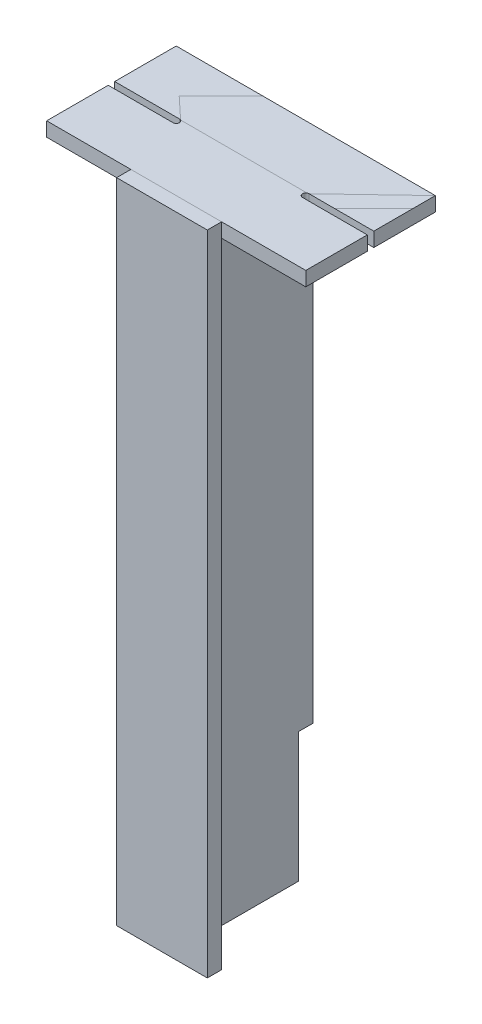
ISO-10303-21;
HEADER;
FILE_DESCRIPTION(('STEP AP214'),'2;1');
FILE_NAME('part.step','',(''),(''),'','','');
FILE_SCHEMA(('AUTOMOTIVE_DESIGN { 1 0 10303 214 1 1 1 1 }'));
ENDSEC;
DATA;
#1=APPLICATION_CONTEXT('core data for automotive mechanical design processes');
#2=APPLICATION_PROTOCOL_DEFINITION('international standard','automotive_design',2000,#1);
#3=PRODUCT_CONTEXT('',#1,'mechanical');
#4=PRODUCT('Part','Part','',(#3));
#5=PRODUCT_RELATED_PRODUCT_CATEGORY('part','',(#4));
#6=PRODUCT_DEFINITION_FORMATION('','',#4);
#7=PRODUCT_DEFINITION_CONTEXT('part definition',#1,'design');
#8=PRODUCT_DEFINITION('design','',#6,#7);
#9=PRODUCT_DEFINITION_SHAPE('','',#8);
#10=(LENGTH_UNIT() NAMED_UNIT(*) SI_UNIT(.MILLI.,.METRE.));
#11=(NAMED_UNIT(*) PLANE_ANGLE_UNIT() SI_UNIT($,.RADIAN.));
#12=(NAMED_UNIT(*) SI_UNIT($,.STERADIAN.) SOLID_ANGLE_UNIT());
#13=UNCERTAINTY_MEASURE_WITH_UNIT(LENGTH_MEASURE(1.E-05),#10,'distance_accuracy_value','');
#14=(GEOMETRIC_REPRESENTATION_CONTEXT(3) GLOBAL_UNCERTAINTY_ASSIGNED_CONTEXT((#13)) GLOBAL_UNIT_ASSIGNED_CONTEXT((#10,
#11,#12)) REPRESENTATION_CONTEXT('',''));
#15=CARTESIAN_POINT('',(0.,0.,0.));
#16=DIRECTION('',(0.,0.,1.));
#17=DIRECTION('',(1.,0.,0.));
#18=AXIS2_PLACEMENT_3D('',#15,#16,#17);
#19=CARTESIAN_POINT('',(-70.01,0.,-0.01));
#20=DIRECTION('',(0.,-1.,0.));
#21=DIRECTION('',(1.,0.,0.));
#22=AXIS2_PLACEMENT_3D('',#19,#20,#21);
#23=PLANE('',#22);
#24=DIRECTION('',(1.,0.,0.));
#25=VECTOR('',#24,1.);
#26=CARTESIAN_POINT('',(0.,0.,22.));
#27=LINE('',#26,#25);
#28=CARTESIAN_POINT('',(-70.,0.,22.));
#29=VERTEX_POINT('',#28);
#30=CARTESIAN_POINT('',(70.,0.,22.));
#31=VERTEX_POINT('',#30);
#32=EDGE_CURVE('P0_E69',#29,#31,#27,.T.);
#33=ORIENTED_EDGE('',*,*,#32,.F.);
#34=DIRECTION('',(0.,0.,1.));
#35=VECTOR('',#34,1.);
#36=CARTESIAN_POINT('',(-70.,1.09170688439818E-13,11.));
#37=LINE('',#36,#35);
#38=CARTESIAN_POINT('',(-70.,0.,0.));
#39=VERTEX_POINT('',#38);
#40=EDGE_CURVE('P0_E56',#39,#29,#37,.T.);
#41=ORIENTED_EDGE('',*,*,#40,.F.);
#42=DIRECTION('',(-1.,0.,0.));
#43=VECTOR('',#42,1.);
#44=CARTESIAN_POINT('',(0.,0.,0.));
#45=LINE('',#44,#43);
#46=CARTESIAN_POINT('',(70.,0.,0.));
#47=VERTEX_POINT('',#46);
#48=EDGE_CURVE('P0_E21',#47,#39,#45,.T.);
#49=ORIENTED_EDGE('',*,*,#48,.F.);
#50=DIRECTION('',(0.,0.,-1.));
#51=VECTOR('',#50,1.);
#52=CARTESIAN_POINT('',(70.,0.,11.));
#53=LINE('',#52,#51);
#54=EDGE_CURVE('P0_E82',#31,#47,#53,.T.);
#55=ORIENTED_EDGE('',*,*,#54,.F.);
#56=EDGE_LOOP('',(#33,#41,#49,#55));
#57=FACE_BOUND('',#56,.T.);
#58=ADVANCED_FACE('P0_F17',(#57),#23,.T.);
#59=CARTESIAN_POINT('',(70.01,-0.00999999999997669,0.));
#60=DIRECTION('',(0.,0.,-1.));
#61=DIRECTION('',(-1.,0.,0.));
#62=AXIS2_PLACEMENT_3D('',#59,#60,#61);
#63=PLANE('',#62);
#64=DIRECTION('',(0.,1.,0.));
#65=VECTOR('',#64,1.);
#66=CARTESIAN_POINT('',(70.,500.,0.));
#67=LINE('',#66,#65);
#68=CARTESIAN_POINT('',(70.,1000.,0.));
#69=VERTEX_POINT('',#68);
#70=EDGE_CURVE('P0_E65',#47,#69,#67,.T.);
#71=ORIENTED_EDGE('',*,*,#70,.F.);
#72=ORIENTED_EDGE('',*,*,#48,.T.);
#73=DIRECTION('',(0.,-1.,0.));
#74=VECTOR('',#73,1.);
#75=CARTESIAN_POINT('',(-70.,500.,0.));
#76=LINE('',#75,#74);
#77=CARTESIAN_POINT('',(-70.,1000.,0.));
#78=VERTEX_POINT('',#77);
#79=EDGE_CURVE('P0_E62',#78,#39,#76,.T.);
#80=ORIENTED_EDGE('',*,*,#79,.F.);
#81=DIRECTION('',(-1.,0.,0.));
#82=VECTOR('',#81,1.);
#83=CARTESIAN_POINT('',(0.,1000.,0.));
#84=LINE('',#83,#82);
#85=EDGE_CURVE('P0_E84',#69,#78,#84,.T.);
#86=ORIENTED_EDGE('',*,*,#85,.F.);
#87=EDGE_LOOP('',(#71,#72,#80,#86));
#88=FACE_BOUND('',#87,.T.);
#89=ADVANCED_FACE('P0_F61',(#88),#63,.T.);
#90=CARTESIAN_POINT('',(-70.,1000.01,-0.01));
#91=DIRECTION('',(-1.,0.,0.));
#92=DIRECTION('',(0.,-1.,0.));
#93=AXIS2_PLACEMENT_3D('',#90,#91,#92);
#94=PLANE('',#93);
#95=DIRECTION('',(0.,-1.,0.));
#96=VECTOR('',#95,1.);
#97=CARTESIAN_POINT('',(-70.,500.,22.));
#98=LINE('',#97,#96);
#99=CARTESIAN_POINT('',(-70.,1000.,22.));
#100=VERTEX_POINT('',#99);
#101=EDGE_CURVE('P0_E71',#100,#29,#98,.T.);
#102=ORIENTED_EDGE('',*,*,#101,.F.);
#103=DIRECTION('',(0.,0.,1.));
#104=VECTOR('',#103,1.);
#105=CARTESIAN_POINT('',(-70.,1000.,11.));
#106=LINE('',#105,#104);
#107=EDGE_CURVE('P0_E75',#78,#100,#106,.T.);
#108=ORIENTED_EDGE('',*,*,#107,.F.);
#109=ORIENTED_EDGE('',*,*,#79,.T.);
#110=ORIENTED_EDGE('',*,*,#40,.T.);
#111=EDGE_LOOP('',(#102,#108,#109,#110));
#112=FACE_BOUND('',#111,.T.);
#113=ADVANCED_FACE('P0_F73',(#112),#94,.T.);
#114=CARTESIAN_POINT('',(-70.01,-0.00999999999997669,22.));
#115=DIRECTION('',(0.,0.,1.));
#116=DIRECTION('',(1.,0.,0.));
#117=AXIS2_PLACEMENT_3D('',#114,#115,#116);
#118=PLANE('',#117);
#119=DIRECTION('',(0.,-1.,0.));
#120=VECTOR('',#119,1.);
#121=CARTESIAN_POINT('',(70.,500.,22.));
#122=LINE('',#121,#120);
#123=CARTESIAN_POINT('',(70.,1000.,22.));
#124=VERTEX_POINT('',#123);
#125=EDGE_CURVE('P0_E36',#124,#31,#122,.T.);
#126=ORIENTED_EDGE('',*,*,#125,.F.);
#127=DIRECTION('',(1.,0.,0.));
#128=VECTOR('',#127,1.);
#129=CARTESIAN_POINT('',(0.,1000.,22.));
#130=LINE('',#129,#128);
#131=EDGE_CURVE('P0_E27',#100,#124,#130,.T.);
#132=ORIENTED_EDGE('',*,*,#131,.F.);
#133=ORIENTED_EDGE('',*,*,#101,.T.);
#134=ORIENTED_EDGE('',*,*,#32,.T.);
#135=EDGE_LOOP('',(#126,#132,#133,#134));
#136=FACE_BOUND('',#135,.T.);
#137=ADVANCED_FACE('P0_F89',(#136),#118,.T.);
#138=CARTESIAN_POINT('',(70.,-0.01,-0.01));
#139=DIRECTION('',(1.,0.,0.));
#140=DIRECTION('',(0.,1.,0.));
#141=AXIS2_PLACEMENT_3D('',#138,#139,#140);
#142=PLANE('',#141);
#143=ORIENTED_EDGE('',*,*,#125,.T.);
#144=ORIENTED_EDGE('',*,*,#54,.T.);
#145=ORIENTED_EDGE('',*,*,#70,.T.);
#146=DIRECTION('',(0.,0.,-1.));
#147=VECTOR('',#146,1.);
#148=CARTESIAN_POINT('',(70.,1000.,11.));
#149=LINE('',#148,#147);
#150=EDGE_CURVE('P0_E11',#124,#69,#149,.T.);
#151=ORIENTED_EDGE('',*,*,#150,.F.);
#152=EDGE_LOOP('',(#143,#144,#145,#151));
#153=FACE_BOUND('',#152,.T.);
#154=ADVANCED_FACE('P0_F91',(#153),#142,.T.);
#155=CARTESIAN_POINT('',(70.01,1000.,-0.01));
#156=DIRECTION('',(0.,1.,0.));
#157=DIRECTION('',(-1.,0.,0.));
#158=AXIS2_PLACEMENT_3D('',#155,#156,#157);
#159=PLANE('',#158);
#160=ORIENTED_EDGE('',*,*,#131,.T.);
#161=ORIENTED_EDGE('',*,*,#150,.T.);
#162=ORIENTED_EDGE('',*,*,#85,.T.);
#163=ORIENTED_EDGE('',*,*,#107,.T.);
#164=EDGE_LOOP('',(#160,#161,#162,#163));
#165=FACE_BOUND('',#164,.T.);
#166=ADVANCED_FACE('P0_F19',(#165),#159,.T.);
#167=CLOSED_SHELL('',(#58,#89,#113,#137,#154,#166));
#168=MANIFOLD_SOLID_BREP('P0_B1',#167);
#169=CARTESIAN_POINT('',(99.99,1000.01,-95.));
#170=DIRECTION('',(0.,0.,-1.));
#171=DIRECTION('',(1.,0.,0.));
#172=AXIS2_PLACEMENT_3D('',#169,#170,#171);
#173=PLANE('',#172);
#174=DIRECTION('',(-1.,0.,0.));
#175=VECTOR('',#174,1.);
#176=CARTESIAN_POINT('',(100.,1000.,-95.));
#177=LINE('',#176,#175);
#178=CARTESIAN_POINT('',(200.,1000.,-95.));
#179=VERTEX_POINT('',#178);
#180=CARTESIAN_POINT('',(100.,1000.,-95.));
#181=VERTEX_POINT('',#180);
#182=EDGE_CURVE('P1_E199',#179,#181,#177,.T.);
#183=ORIENTED_EDGE('',*,*,#182,.F.);
#184=DIRECTION('',(0.,1.,0.));
#185=VECTOR('',#184,1.);
#186=CARTESIAN_POINT('',(200.,989.,-95.));
#187=LINE('',#186,#185);
#188=CARTESIAN_POINT('',(200.,978.,-95.));
#189=VERTEX_POINT('',#188);
#190=EDGE_CURVE('P1_E122',#189,#179,#187,.T.);
#191=ORIENTED_EDGE('',*,*,#190,.F.);
#192=DIRECTION('',(1.,0.,0.));
#193=VECTOR('',#192,1.);
#194=CARTESIAN_POINT('',(0.,978.,-95.));
#195=LINE('',#194,#193);
#196=CARTESIAN_POINT('',(100.,978.,-95.));
#197=VERTEX_POINT('',#196);
#198=EDGE_CURVE('P1_E121',#197,#189,#195,.T.);
#199=ORIENTED_EDGE('',*,*,#198,.F.);
#200=DIRECTION('',(0.,-1.,0.));
#201=VECTOR('',#200,1.);
#202=CARTESIAN_POINT('',(100.,989.,-95.));
#203=LINE('',#202,#201);
#204=EDGE_CURVE('P1_E109',#181,#197,#203,.T.);
#205=ORIENTED_EDGE('',*,*,#204,.F.);
#206=EDGE_LOOP('',(#183,#191,#199,#205));
#207=FACE_BOUND('',#206,.T.);
#208=ADVANCED_FACE('P1_F17',(#207),#173,.T.);
#209=CARTESIAN_POINT('',(100.,1000.,-100.));
#210=DIRECTION('',(0.,-1.,0.));
#211=DIRECTION('',(0.,0.,-1.));
#212=AXIS2_PLACEMENT_3D('',#209,#210,#211);
#213=CYLINDRICAL_SURFACE('',#212,5.);
#214=CARTESIAN_POINT('',(100.,1000.,-100.));
#215=DIRECTION('',(0.,-1.,0.));
#216=DIRECTION('',(0.,0.,-1.));
#217=AXIS2_PLACEMENT_3D('',#214,#215,#216);
#218=CIRCLE('',#217,5.);
#219=CARTESIAN_POINT('',(100.,1000.,-105.));
#220=VERTEX_POINT('',#219);
#221=EDGE_CURVE('P1_E115',#181,#220,#218,.T.);
#222=ORIENTED_EDGE('',*,*,#221,.F.);
#223=ORIENTED_EDGE('',*,*,#204,.T.);
#224=CARTESIAN_POINT('',(100.,978.,-100.));
#225=DIRECTION('',(0.,-1.,0.));
#226=DIRECTION('',(0.,0.,-1.));
#227=AXIS2_PLACEMENT_3D('',#224,#225,#226);
#228=CIRCLE('',#227,5.);
#229=CARTESIAN_POINT('',(100.,978.,-105.));
#230=VERTEX_POINT('',#229);
#231=EDGE_CURVE('P1_E21',#230,#197,#228,.F.);
#232=ORIENTED_EDGE('',*,*,#231,.F.);
#233=DIRECTION('',(0.,-1.,0.));
#234=VECTOR('',#233,1.);
#235=CARTESIAN_POINT('',(100.,989.,-105.));
#236=LINE('',#235,#234);
#237=EDGE_CURVE('P1_E104',#220,#230,#236,.T.);
#238=ORIENTED_EDGE('',*,*,#237,.F.);
#239=EDGE_LOOP('',(#222,#223,#232,#238));
#240=FACE_BOUND('',#239,.T.);
#241=ADVANCED_FACE('P1_F111',(#240),#213,.F.);
#242=CARTESIAN_POINT('',(200.01,1000.01,-105.));
#243=DIRECTION('',(0.,0.,1.));
#244=DIRECTION('',(-1.,0.,0.));
#245=AXIS2_PLACEMENT_3D('',#242,#243,#244);
#246=PLANE('',#245);
#247=DIRECTION('',(1.,0.,0.));
#248=VECTOR('',#247,1.);
#249=CARTESIAN_POINT('',(100.,1000.,-105.));
#250=LINE('',#249,#248);
#251=CARTESIAN_POINT('',(200.,1000.,-105.));
#252=VERTEX_POINT('',#251);
#253=EDGE_CURVE('P1_E175',#220,#252,#250,.T.);
#254=ORIENTED_EDGE('',*,*,#253,.F.);
#255=ORIENTED_EDGE('',*,*,#237,.T.);
#256=DIRECTION('',(-1.,0.,0.));
#257=VECTOR('',#256,1.);
#258=CARTESIAN_POINT('',(0.,978.,-105.));
#259=LINE('',#258,#257);
#260=CARTESIAN_POINT('',(200.,978.,-105.));
#261=VERTEX_POINT('',#260);
#262=EDGE_CURVE('P1_E128',#261,#230,#259,.T.);
#263=ORIENTED_EDGE('',*,*,#262,.F.);
#264=DIRECTION('',(0.,-1.,0.));
#265=VECTOR('',#264,1.);
#266=CARTESIAN_POINT('',(200.,989.,-105.));
#267=LINE('',#266,#265);
#268=EDGE_CURVE('P1_E131',#252,#261,#267,.T.);
#269=ORIENTED_EDGE('',*,*,#268,.F.);
#270=EDGE_LOOP('',(#254,#255,#263,#269));
#271=FACE_BOUND('',#270,.T.);
#272=ADVANCED_FACE('P1_F288',(#271),#246,.T.);
#273=CARTESIAN_POINT('',(200.,1000.01,-104.99));
#274=DIRECTION('',(1.,0.,0.));
#275=DIRECTION('',(0.,-1.,0.));
#276=AXIS2_PLACEMENT_3D('',#273,#274,#275);
#277=PLANE('',#276);
#278=DIRECTION('',(0.,-1.,0.));
#279=VECTOR('',#278,1.);
#280=CARTESIAN_POINT('',(200.,989.,-200.));
#281=LINE('',#280,#279);
#282=CARTESIAN_POINT('',(200.,1000.,-200.));
#283=VERTEX_POINT('',#282);
#284=CARTESIAN_POINT('',(200.,978.,-200.));
#285=VERTEX_POINT('',#284);
#286=EDGE_CURVE('P1_E169',#283,#285,#281,.T.);
#287=ORIENTED_EDGE('',*,*,#286,.F.);
#288=DIRECTION('',(0.,0.,-1.));
#289=VECTOR('',#288,1.);
#290=CARTESIAN_POINT('',(200.,1000.,-100.));
#291=LINE('',#290,#289);
#292=EDGE_CURVE('P1_E170',#252,#283,#291,.T.);
#293=ORIENTED_EDGE('',*,*,#292,.F.);
#294=ORIENTED_EDGE('',*,*,#268,.T.);
#295=DIRECTION('',(0.,0.,1.));
#296=VECTOR('',#295,1.);
#297=CARTESIAN_POINT('',(200.,978.,-100.));
#298=LINE('',#297,#296);
#299=EDGE_CURVE('P1_E129',#285,#261,#298,.T.);
#300=ORIENTED_EDGE('',*,*,#299,.F.);
#301=EDGE_LOOP('',(#287,#293,#294,#300));
#302=FACE_BOUND('',#301,.T.);
#303=ADVANCED_FACE('P1_F287',(#302),#277,.T.);
#304=CARTESIAN_POINT('',(200.01,978.,0.01));
#305=DIRECTION('',(0.,-1.,0.));
#306=DIRECTION('',(-1.,0.,0.));
#307=AXIS2_PLACEMENT_3D('',#304,#305,#306);
#308=PLANE('',#307);
#309=DIRECTION('',(-1.,0.,0.));
#310=VECTOR('',#309,1.);
#311=CARTESIAN_POINT('',(-150.,978.,-95.));
#312=LINE('',#311,#310);
#313=CARTESIAN_POINT('',(-100.,978.,-95.));
#314=VERTEX_POINT('',#313);
#315=CARTESIAN_POINT('',(-200.,978.,-95.));
#316=VERTEX_POINT('',#315);
#317=EDGE_CURVE('P1_E149',#314,#316,#312,.T.);
#318=ORIENTED_EDGE('',*,*,#317,.F.);
#319=CARTESIAN_POINT('',(-100.,978.,-100.));
#320=DIRECTION('',(0.,-1.,0.));
#321=DIRECTION('',(0.,0.,-1.));
#322=AXIS2_PLACEMENT_3D('',#319,#320,#321);
#323=CIRCLE('',#322,5.);
#324=CARTESIAN_POINT('',(-100.,978.,-105.));
#325=VERTEX_POINT('',#324);
#326=EDGE_CURVE('P1_E197',#325,#314,#323,.T.);
#327=ORIENTED_EDGE('',*,*,#326,.F.);
#328=DIRECTION('',(1.,0.,0.));
#329=VECTOR('',#328,1.);
#330=CARTESIAN_POINT('',(-150.,978.,-105.));
#331=LINE('',#330,#329);
#332=CARTESIAN_POINT('',(-200.,978.,-105.));
#333=VERTEX_POINT('',#332);
#334=EDGE_CURVE('P1_E155',#333,#325,#331,.T.);
#335=ORIENTED_EDGE('',*,*,#334,.F.);
#336=DIRECTION('',(0.,0.,1.));
#337=VECTOR('',#336,1.);
#338=CARTESIAN_POINT('',(-200.,978.,-152.5));
#339=LINE('',#338,#337);
#340=CARTESIAN_POINT('',(-200.,978.,-200.));
#341=VERTEX_POINT('',#340);
#342=EDGE_CURVE('P1_E159',#341,#333,#339,.T.);
#343=ORIENTED_EDGE('',*,*,#342,.F.);
#344=DIRECTION('',(-1.,0.,0.));
#345=VECTOR('',#344,1.);
#346=CARTESIAN_POINT('',(0.,978.,-200.));
#347=LINE('',#346,#345);
#348=EDGE_CURVE('P1_E167',#285,#341,#347,.T.);
#349=ORIENTED_EDGE('',*,*,#348,.F.);
#350=ORIENTED_EDGE('',*,*,#299,.T.);
#351=ORIENTED_EDGE('',*,*,#262,.T.);
#352=ORIENTED_EDGE('',*,*,#231,.T.);
#353=ORIENTED_EDGE('',*,*,#198,.T.);
#354=DIRECTION('',(0.,0.,-1.));
#355=VECTOR('',#354,1.);
#356=CARTESIAN_POINT('',(200.,978.,-47.5));
#357=LINE('',#356,#355);
#358=CARTESIAN_POINT('',(200.,978.,0.));
#359=VERTEX_POINT('',#358);
#360=EDGE_CURVE('P1_E189',#359,#189,#357,.T.);
#361=ORIENTED_EDGE('',*,*,#360,.F.);
#362=DIRECTION('',(1.,0.,0.));
#363=VECTOR('',#362,1.);
#364=CARTESIAN_POINT('',(0.,978.,0.));
#365=LINE('',#364,#363);
#366=CARTESIAN_POINT('',(-200.,978.,0.));
#367=VERTEX_POINT('',#366);
#368=EDGE_CURVE('P1_E140',#367,#359,#365,.T.);
#369=ORIENTED_EDGE('',*,*,#368,.F.);
#370=DIRECTION('',(0.,0.,1.));
#371=VECTOR('',#370,1.);
#372=CARTESIAN_POINT('',(-200.,978.,-47.5));
#373=LINE('',#372,#371);
#374=EDGE_CURVE('P1_E138',#316,#367,#373,.T.);
#375=ORIENTED_EDGE('',*,*,#374,.F.);
#376=EDGE_LOOP('',(#318,#327,#335,#343,#349,#350,#351,#352,#353,#361,#369,#375));
#377=FACE_BOUND('',#376,.T.);
#378=ADVANCED_FACE('P1_F126',(#377),#308,.T.);
#379=CARTESIAN_POINT('',(200.,1000.01,0.01));
#380=DIRECTION('',(1.,0.,0.));
#381=DIRECTION('',(0.,-1.,0.));
#382=AXIS2_PLACEMENT_3D('',#379,#380,#381);
#383=PLANE('',#382);
#384=DIRECTION('',(0.,1.,0.));
#385=VECTOR('',#384,1.);
#386=CARTESIAN_POINT('',(200.,989.,0.));
#387=LINE('',#386,#385);
#388=CARTESIAN_POINT('',(200.,1000.,0.));
#389=VERTEX_POINT('',#388);
#390=EDGE_CURVE('P1_E146',#359,#389,#387,.T.);
#391=ORIENTED_EDGE('',*,*,#390,.F.);
#392=ORIENTED_EDGE('',*,*,#360,.T.);
#393=ORIENTED_EDGE('',*,*,#190,.T.);
#394=DIRECTION('',(0.,0.,-1.));
#395=VECTOR('',#394,1.);
#396=CARTESIAN_POINT('',(200.,1000.,-100.));
#397=LINE('',#396,#395);
#398=EDGE_CURVE('P1_E203',#389,#179,#397,.T.);
#399=ORIENTED_EDGE('',*,*,#398,.F.);
#400=EDGE_LOOP('',(#391,#392,#393,#399));
#401=FACE_BOUND('',#400,.T.);
#402=ADVANCED_FACE('P1_F317',(#401),#383,.T.);
#403=CARTESIAN_POINT('',(200.01,977.99,-200.));
#404=DIRECTION('',(0.,0.,-1.));
#405=DIRECTION('',(-1.,0.,0.));
#406=AXIS2_PLACEMENT_3D('',#403,#404,#405);
#407=PLANE('',#406);
#408=DIRECTION('',(-1.,0.,0.));
#409=VECTOR('',#408,1.);
#410=CARTESIAN_POINT('',(-100.,1000.,-200.));
#411=LINE('',#410,#409);
#412=CARTESIAN_POINT('',(-200.,1000.,-200.));
#413=VERTEX_POINT('',#412);
#414=EDGE_CURVE('P1_E145',#283,#413,#411,.T.);
#415=ORIENTED_EDGE('',*,*,#414,.F.);
#416=ORIENTED_EDGE('',*,*,#286,.T.);
#417=ORIENTED_EDGE('',*,*,#348,.T.);
#418=DIRECTION('',(0.,-1.,0.));
#419=VECTOR('',#418,1.);
#420=CARTESIAN_POINT('',(-200.,989.,-200.));
#421=LINE('',#420,#419);
#422=EDGE_CURVE('P1_E164',#413,#341,#421,.T.);
#423=ORIENTED_EDGE('',*,*,#422,.F.);
#424=EDGE_LOOP('',(#415,#416,#417,#423));
#425=FACE_BOUND('',#424,.T.);
#426=ADVANCED_FACE('P1_F268',(#425),#407,.T.);
#427=CARTESIAN_POINT('',(-200.,977.99,-104.99));
#428=DIRECTION('',(-1.,0.,0.));
#429=DIRECTION('',(0.,1.,0.));
#430=AXIS2_PLACEMENT_3D('',#427,#428,#429);
#431=PLANE('',#430);
#432=ORIENTED_EDGE('',*,*,#422,.T.);
#433=ORIENTED_EDGE('',*,*,#342,.T.);
#434=DIRECTION('',(0.,-1.,0.));
#435=VECTOR('',#434,1.);
#436=CARTESIAN_POINT('',(-200.,989.,-105.));
#437=LINE('',#436,#435);
#438=CARTESIAN_POINT('',(-200.,1000.,-105.));
#439=VERTEX_POINT('',#438);
#440=EDGE_CURVE('P1_E158',#439,#333,#437,.T.);
#441=ORIENTED_EDGE('',*,*,#440,.F.);
#442=DIRECTION('',(0.,0.,1.));
#443=VECTOR('',#442,1.);
#444=CARTESIAN_POINT('',(-200.,1000.,-100.));
#445=LINE('',#444,#443);
#446=EDGE_CURVE('P1_E251',#413,#439,#445,.T.);
#447=ORIENTED_EDGE('',*,*,#446,.F.);
#448=EDGE_LOOP('',(#432,#433,#441,#447));
#449=FACE_BOUND('',#448,.T.);
#450=ADVANCED_FACE('P1_F272',(#449),#431,.T.);
#451=CARTESIAN_POINT('',(-99.99,1000.01,-105.));
#452=DIRECTION('',(0.,0.,1.));
#453=DIRECTION('',(-1.,0.,0.));
#454=AXIS2_PLACEMENT_3D('',#451,#452,#453);
#455=PLANE('',#454);
#456=DIRECTION('',(1.,0.,0.));
#457=VECTOR('',#456,1.);
#458=CARTESIAN_POINT('',(-100.,1000.,-105.));
#459=LINE('',#458,#457);
#460=CARTESIAN_POINT('',(-100.,1000.,-105.));
#461=VERTEX_POINT('',#460);
#462=EDGE_CURVE('P1_E196',#439,#461,#459,.T.);
#463=ORIENTED_EDGE('',*,*,#462,.F.);
#464=ORIENTED_EDGE('',*,*,#440,.T.);
#465=ORIENTED_EDGE('',*,*,#334,.T.);
#466=DIRECTION('',(0.,-1.,0.));
#467=VECTOR('',#466,1.);
#468=CARTESIAN_POINT('',(-100.,989.,-105.));
#469=LINE('',#468,#467);
#470=EDGE_CURVE('P1_E152',#461,#325,#469,.T.);
#471=ORIENTED_EDGE('',*,*,#470,.F.);
#472=EDGE_LOOP('',(#463,#464,#465,#471));
#473=FACE_BOUND('',#472,.T.);
#474=ADVANCED_FACE('P1_F275',(#473),#455,.T.);
#475=CARTESIAN_POINT('',(-100.,1000.,-100.));
#476=DIRECTION('',(0.,-1.,0.));
#477=DIRECTION('',(0.,0.,-1.));
#478=AXIS2_PLACEMENT_3D('',#475,#476,#477);
#479=CYLINDRICAL_SURFACE('',#478,5.);
#480=CARTESIAN_POINT('',(-100.,1000.,-100.));
#481=DIRECTION('',(0.,-1.,0.));
#482=DIRECTION('',(0.,0.,-1.));
#483=AXIS2_PLACEMENT_3D('',#480,#481,#482);
#484=CIRCLE('',#483,5.);
#485=CARTESIAN_POINT('',(-100.,1000.,-95.));
#486=VERTEX_POINT('',#485);
#487=EDGE_CURVE('P1_E192',#461,#486,#484,.T.);
#488=ORIENTED_EDGE('',*,*,#487,.F.);
#489=ORIENTED_EDGE('',*,*,#470,.T.);
#490=ORIENTED_EDGE('',*,*,#326,.T.);
#491=DIRECTION('',(0.,-1.,0.));
#492=VECTOR('',#491,1.);
#493=CARTESIAN_POINT('',(-100.,989.,-95.));
#494=LINE('',#493,#492);
#495=EDGE_CURVE('P1_E151',#486,#314,#494,.T.);
#496=ORIENTED_EDGE('',*,*,#495,.F.);
#497=EDGE_LOOP('',(#488,#489,#490,#496));
#498=FACE_BOUND('',#497,.T.);
#499=ADVANCED_FACE('P1_F285',(#498),#479,.F.);
#500=CARTESIAN_POINT('',(-200.01,1000.01,-95.));
#501=DIRECTION('',(0.,0.,-1.));
#502=DIRECTION('',(1.,0.,0.));
#503=AXIS2_PLACEMENT_3D('',#500,#501,#502);
#504=PLANE('',#503);
#505=DIRECTION('',(-1.,0.,0.));
#506=VECTOR('',#505,1.);
#507=CARTESIAN_POINT('',(-100.,1000.,-95.));
#508=LINE('',#507,#506);
#509=CARTESIAN_POINT('',(-200.,1000.,-95.));
#510=VERTEX_POINT('',#509);
#511=EDGE_CURVE('P1_E195',#486,#510,#508,.T.);
#512=ORIENTED_EDGE('',*,*,#511,.F.);
#513=ORIENTED_EDGE('',*,*,#495,.T.);
#514=ORIENTED_EDGE('',*,*,#317,.T.);
#515=DIRECTION('',(0.,-1.,0.));
#516=VECTOR('',#515,1.);
#517=CARTESIAN_POINT('',(-200.,989.,-95.));
#518=LINE('',#517,#516);
#519=EDGE_CURVE('P1_E141',#510,#316,#518,.T.);
#520=ORIENTED_EDGE('',*,*,#519,.F.);
#521=EDGE_LOOP('',(#512,#513,#514,#520));
#522=FACE_BOUND('',#521,.T.);
#523=ADVANCED_FACE('P1_F283',(#522),#504,.T.);
#524=CARTESIAN_POINT('',(-200.,977.99,0.01));
#525=DIRECTION('',(-1.,0.,0.));
#526=DIRECTION('',(0.,1.,0.));
#527=AXIS2_PLACEMENT_3D('',#524,#525,#526);
#528=PLANE('',#527);
#529=DIRECTION('',(0.,-1.,0.));
#530=VECTOR('',#529,1.);
#531=CARTESIAN_POINT('',(-200.,989.,0.));
#532=LINE('',#531,#530);
#533=CARTESIAN_POINT('',(-200.,1000.,0.));
#534=VERTEX_POINT('',#533);
#535=EDGE_CURVE('P1_E36',#534,#367,#532,.T.);
#536=ORIENTED_EDGE('',*,*,#535,.F.);
#537=DIRECTION('',(0.,0.,1.));
#538=VECTOR('',#537,1.);
#539=CARTESIAN_POINT('',(-200.,1000.,-100.));
#540=LINE('',#539,#538);
#541=EDGE_CURVE('P1_E27',#510,#534,#540,.T.);
#542=ORIENTED_EDGE('',*,*,#541,.F.);
#543=ORIENTED_EDGE('',*,*,#519,.T.);
#544=ORIENTED_EDGE('',*,*,#374,.T.);
#545=EDGE_LOOP('',(#536,#542,#543,#544));
#546=FACE_BOUND('',#545,.T.);
#547=ADVANCED_FACE('P1_F231',(#546),#528,.T.);
#548=CARTESIAN_POINT('',(-200.01,977.99,0.));
#549=DIRECTION('',(0.,0.,1.));
#550=DIRECTION('',(1.,0.,0.));
#551=AXIS2_PLACEMENT_3D('',#548,#549,#550);
#552=PLANE('',#551);
#553=DIRECTION('',(1.,0.,0.));
#554=VECTOR('',#553,1.);
#555=CARTESIAN_POINT('',(-100.,1000.,0.));
#556=LINE('',#555,#554);
#557=EDGE_CURVE('P1_E11',#534,#389,#556,.T.);
#558=ORIENTED_EDGE('',*,*,#557,.F.);
#559=ORIENTED_EDGE('',*,*,#535,.T.);
#560=ORIENTED_EDGE('',*,*,#368,.T.);
#561=ORIENTED_EDGE('',*,*,#390,.T.);
#562=EDGE_LOOP('',(#558,#559,#560,#561));
#563=FACE_BOUND('',#562,.T.);
#564=ADVANCED_FACE('P1_F227',(#563),#552,.T.);
#565=CARTESIAN_POINT('',(-200.01,1000.,0.01));
#566=DIRECTION('',(0.,1.,0.));
#567=DIRECTION('',(1.,0.,0.));
#568=AXIS2_PLACEMENT_3D('',#565,#566,#567);
#569=PLANE('',#568);
#570=ORIENTED_EDGE('',*,*,#541,.T.);
#571=ORIENTED_EDGE('',*,*,#557,.T.);
#572=ORIENTED_EDGE('',*,*,#398,.T.);
#573=ORIENTED_EDGE('',*,*,#182,.T.);
#574=ORIENTED_EDGE('',*,*,#221,.T.);
#575=ORIENTED_EDGE('',*,*,#253,.T.);
#576=ORIENTED_EDGE('',*,*,#292,.T.);
#577=ORIENTED_EDGE('',*,*,#414,.T.);
#578=ORIENTED_EDGE('',*,*,#446,.T.);
#579=ORIENTED_EDGE('',*,*,#462,.T.);
#580=ORIENTED_EDGE('',*,*,#487,.T.);
#581=ORIENTED_EDGE('',*,*,#511,.T.);
#582=EDGE_LOOP('',(#570,#571,#572,#573,#574,#575,#576,#577,#578,#579,#580,#581));
#583=FACE_BOUND('',#582,.T.);
#584=ADVANCED_FACE('P1_F19',(#583),#569,.T.);
#585=CLOSED_SHELL('',(#208,#241,#272,#303,#378,#402,#426,#450,#474,#499,#523,#547,#564,#584));
#586=MANIFOLD_SOLID_BREP('P1_B1',#585);
#587=CARTESIAN_POINT('',(99.99,1000.01,-95.));
#588=DIRECTION('',(0.,0.,-1.));
#589=DIRECTION('',(1.,0.,0.));
#590=AXIS2_PLACEMENT_3D('',#587,#588,#589);
#591=PLANE('',#590);
#592=DIRECTION('',(-1.,0.,0.));
#593=VECTOR('',#592,1.);
#594=CARTESIAN_POINT('',(100.,1000.,-95.));
#595=LINE('',#594,#593);
#596=CARTESIAN_POINT('',(200.,1000.,-95.));
#597=VERTEX_POINT('',#596);
#598=CARTESIAN_POINT('',(100.,1000.,-95.));
#599=VERTEX_POINT('',#598);
#600=EDGE_CURVE('P2_E199',#597,#599,#595,.T.);
#601=ORIENTED_EDGE('',*,*,#600,.F.);
#602=DIRECTION('',(0.,1.,0.));
#603=VECTOR('',#602,1.);
#604=CARTESIAN_POINT('',(200.,989.,-95.));
#605=LINE('',#604,#603);
#606=CARTESIAN_POINT('',(200.,978.,-95.));
#607=VERTEX_POINT('',#606);
#608=EDGE_CURVE('P2_E122',#607,#597,#605,.T.);
#609=ORIENTED_EDGE('',*,*,#608,.F.);
#610=DIRECTION('',(1.,0.,0.));
#611=VECTOR('',#610,1.);
#612=CARTESIAN_POINT('',(0.,978.,-95.));
#613=LINE('',#612,#611);
#614=CARTESIAN_POINT('',(100.,978.,-95.));
#615=VERTEX_POINT('',#614);
#616=EDGE_CURVE('P2_E121',#615,#607,#613,.T.);
#617=ORIENTED_EDGE('',*,*,#616,.F.);
#618=DIRECTION('',(0.,-1.,0.));
#619=VECTOR('',#618,1.);
#620=CARTESIAN_POINT('',(100.,989.,-95.));
#621=LINE('',#620,#619);
#622=EDGE_CURVE('P2_E109',#599,#615,#621,.T.);
#623=ORIENTED_EDGE('',*,*,#622,.F.);
#624=EDGE_LOOP('',(#601,#609,#617,#623));
#625=FACE_BOUND('',#624,.T.);
#626=ADVANCED_FACE('P2_F17',(#625),#591,.T.);
#627=CARTESIAN_POINT('',(100.,1000.,-100.));
#628=DIRECTION('',(0.,-1.,0.));
#629=DIRECTION('',(0.,0.,-1.));
#630=AXIS2_PLACEMENT_3D('',#627,#628,#629);
#631=CYLINDRICAL_SURFACE('',#630,5.);
#632=CARTESIAN_POINT('',(100.,1000.,-100.));
#633=DIRECTION('',(0.,-1.,0.));
#634=DIRECTION('',(0.,0.,-1.));
#635=AXIS2_PLACEMENT_3D('',#632,#633,#634);
#636=CIRCLE('',#635,5.);
#637=CARTESIAN_POINT('',(100.,1000.,-105.));
#638=VERTEX_POINT('',#637);
#639=EDGE_CURVE('P2_E115',#599,#638,#636,.T.);
#640=ORIENTED_EDGE('',*,*,#639,.F.);
#641=ORIENTED_EDGE('',*,*,#622,.T.);
#642=CARTESIAN_POINT('',(100.,978.,-100.));
#643=DIRECTION('',(0.,-1.,0.));
#644=DIRECTION('',(0.,0.,-1.));
#645=AXIS2_PLACEMENT_3D('',#642,#643,#644);
#646=CIRCLE('',#645,5.);
#647=CARTESIAN_POINT('',(100.,978.,-105.));
#648=VERTEX_POINT('',#647);
#649=EDGE_CURVE('P2_E21',#648,#615,#646,.F.);
#650=ORIENTED_EDGE('',*,*,#649,.F.);
#651=DIRECTION('',(0.,-1.,0.));
#652=VECTOR('',#651,1.);
#653=CARTESIAN_POINT('',(100.,989.,-105.));
#654=LINE('',#653,#652);
#655=EDGE_CURVE('P2_E104',#638,#648,#654,.T.);
#656=ORIENTED_EDGE('',*,*,#655,.F.);
#657=EDGE_LOOP('',(#640,#641,#650,#656));
#658=FACE_BOUND('',#657,.T.);
#659=ADVANCED_FACE('P2_F111',(#658),#631,.F.);
#660=CARTESIAN_POINT('',(200.01,1000.01,-105.));
#661=DIRECTION('',(0.,0.,1.));
#662=DIRECTION('',(-1.,0.,0.));
#663=AXIS2_PLACEMENT_3D('',#660,#661,#662);
#664=PLANE('',#663);
#665=DIRECTION('',(1.,0.,0.));
#666=VECTOR('',#665,1.);
#667=CARTESIAN_POINT('',(100.,1000.,-105.));
#668=LINE('',#667,#666);
#669=CARTESIAN_POINT('',(200.,1000.,-105.));
#670=VERTEX_POINT('',#669);
#671=EDGE_CURVE('P2_E175',#638,#670,#668,.T.);
#672=ORIENTED_EDGE('',*,*,#671,.F.);
#673=ORIENTED_EDGE('',*,*,#655,.T.);
#674=DIRECTION('',(-1.,0.,0.));
#675=VECTOR('',#674,1.);
#676=CARTESIAN_POINT('',(0.,978.,-105.));
#677=LINE('',#676,#675);
#678=CARTESIAN_POINT('',(200.,978.,-105.));
#679=VERTEX_POINT('',#678);
#680=EDGE_CURVE('P2_E128',#679,#648,#677,.T.);
#681=ORIENTED_EDGE('',*,*,#680,.F.);
#682=DIRECTION('',(0.,-1.,0.));
#683=VECTOR('',#682,1.);
#684=CARTESIAN_POINT('',(200.,989.,-105.));
#685=LINE('',#684,#683);
#686=EDGE_CURVE('P2_E131',#670,#679,#685,.T.);
#687=ORIENTED_EDGE('',*,*,#686,.F.);
#688=EDGE_LOOP('',(#672,#673,#681,#687));
#689=FACE_BOUND('',#688,.T.);
#690=ADVANCED_FACE('P2_F288',(#689),#664,.T.);
#691=CARTESIAN_POINT('',(200.,1000.01,-104.99));
#692=DIRECTION('',(1.,0.,0.));
#693=DIRECTION('',(0.,-1.,0.));
#694=AXIS2_PLACEMENT_3D('',#691,#692,#693);
#695=PLANE('',#694);
#696=DIRECTION('',(0.,-1.,0.));
#697=VECTOR('',#696,1.);
#698=CARTESIAN_POINT('',(200.,989.,-200.));
#699=LINE('',#698,#697);
#700=CARTESIAN_POINT('',(200.,1000.,-200.));
#701=VERTEX_POINT('',#700);
#702=CARTESIAN_POINT('',(200.,978.,-200.));
#703=VERTEX_POINT('',#702);
#704=EDGE_CURVE('P2_E169',#701,#703,#699,.T.);
#705=ORIENTED_EDGE('',*,*,#704,.F.);
#706=DIRECTION('',(0.,0.,-1.));
#707=VECTOR('',#706,1.);
#708=CARTESIAN_POINT('',(200.,1000.,-100.));
#709=LINE('',#708,#707);
#710=EDGE_CURVE('P2_E170',#670,#701,#709,.T.);
#711=ORIENTED_EDGE('',*,*,#710,.F.);
#712=ORIENTED_EDGE('',*,*,#686,.T.);
#713=DIRECTION('',(0.,0.,1.));
#714=VECTOR('',#713,1.);
#715=CARTESIAN_POINT('',(200.,978.,-100.));
#716=LINE('',#715,#714);
#717=EDGE_CURVE('P2_E129',#703,#679,#716,.T.);
#718=ORIENTED_EDGE('',*,*,#717,.F.);
#719=EDGE_LOOP('',(#705,#711,#712,#718));
#720=FACE_BOUND('',#719,.T.);
#721=ADVANCED_FACE('P2_F287',(#720),#695,.T.);
#722=CARTESIAN_POINT('',(200.01,978.,0.01));
#723=DIRECTION('',(0.,-1.,0.));
#724=DIRECTION('',(-1.,0.,0.));
#725=AXIS2_PLACEMENT_3D('',#722,#723,#724);
#726=PLANE('',#725);
#727=DIRECTION('',(-1.,0.,0.));
#728=VECTOR('',#727,1.);
#729=CARTESIAN_POINT('',(-150.,978.,-95.));
#730=LINE('',#729,#728);
#731=CARTESIAN_POINT('',(-100.,978.,-95.));
#732=VERTEX_POINT('',#731);
#733=CARTESIAN_POINT('',(-200.,978.,-95.));
#734=VERTEX_POINT('',#733);
#735=EDGE_CURVE('P2_E149',#732,#734,#730,.T.);
#736=ORIENTED_EDGE('',*,*,#735,.F.);
#737=CARTESIAN_POINT('',(-100.,978.,-100.));
#738=DIRECTION('',(0.,-1.,0.));
#739=DIRECTION('',(0.,0.,-1.));
#740=AXIS2_PLACEMENT_3D('',#737,#738,#739);
#741=CIRCLE('',#740,5.);
#742=CARTESIAN_POINT('',(-100.,978.,-105.));
#743=VERTEX_POINT('',#742);
#744=EDGE_CURVE('P2_E197',#743,#732,#741,.T.);
#745=ORIENTED_EDGE('',*,*,#744,.F.);
#746=DIRECTION('',(1.,0.,0.));
#747=VECTOR('',#746,1.);
#748=CARTESIAN_POINT('',(-150.,978.,-105.));
#749=LINE('',#748,#747);
#750=CARTESIAN_POINT('',(-200.,978.,-105.));
#751=VERTEX_POINT('',#750);
#752=EDGE_CURVE('P2_E155',#751,#743,#749,.T.);
#753=ORIENTED_EDGE('',*,*,#752,.F.);
#754=DIRECTION('',(0.,0.,1.));
#755=VECTOR('',#754,1.);
#756=CARTESIAN_POINT('',(-200.,978.,-152.5));
#757=LINE('',#756,#755);
#758=CARTESIAN_POINT('',(-200.,978.,-200.));
#759=VERTEX_POINT('',#758);
#760=EDGE_CURVE('P2_E159',#759,#751,#757,.T.);
#761=ORIENTED_EDGE('',*,*,#760,.F.);
#762=DIRECTION('',(-1.,0.,0.));
#763=VECTOR('',#762,1.);
#764=CARTESIAN_POINT('',(0.,978.,-200.));
#765=LINE('',#764,#763);
#766=EDGE_CURVE('P2_E167',#703,#759,#765,.T.);
#767=ORIENTED_EDGE('',*,*,#766,.F.);
#768=ORIENTED_EDGE('',*,*,#717,.T.);
#769=ORIENTED_EDGE('',*,*,#680,.T.);
#770=ORIENTED_EDGE('',*,*,#649,.T.);
#771=ORIENTED_EDGE('',*,*,#616,.T.);
#772=DIRECTION('',(0.,0.,-1.));
#773=VECTOR('',#772,1.);
#774=CARTESIAN_POINT('',(200.,978.,-47.5));
#775=LINE('',#774,#773);
#776=CARTESIAN_POINT('',(200.,978.,0.));
#777=VERTEX_POINT('',#776);
#778=EDGE_CURVE('P2_E189',#777,#607,#775,.T.);
#779=ORIENTED_EDGE('',*,*,#778,.F.);
#780=DIRECTION('',(1.,0.,0.));
#781=VECTOR('',#780,1.);
#782=CARTESIAN_POINT('',(0.,978.,0.));
#783=LINE('',#782,#781);
#784=CARTESIAN_POINT('',(-200.,978.,0.));
#785=VERTEX_POINT('',#784);
#786=EDGE_CURVE('P2_E140',#785,#777,#783,.T.);
#787=ORIENTED_EDGE('',*,*,#786,.F.);
#788=DIRECTION('',(0.,0.,1.));
#789=VECTOR('',#788,1.);
#790=CARTESIAN_POINT('',(-200.,978.,-47.5));
#791=LINE('',#790,#789);
#792=EDGE_CURVE('P2_E138',#734,#785,#791,.T.);
#793=ORIENTED_EDGE('',*,*,#792,.F.);
#794=EDGE_LOOP('',(#736,#745,#753,#761,#767,#768,#769,#770,#771,#779,#787,#793));
#795=FACE_BOUND('',#794,.T.);
#796=ADVANCED_FACE('P2_F126',(#795),#726,.T.);
#797=CARTESIAN_POINT('',(200.,1000.01,0.01));
#798=DIRECTION('',(1.,0.,0.));
#799=DIRECTION('',(0.,-1.,0.));
#800=AXIS2_PLACEMENT_3D('',#797,#798,#799);
#801=PLANE('',#800);
#802=DIRECTION('',(0.,1.,0.));
#803=VECTOR('',#802,1.);
#804=CARTESIAN_POINT('',(200.,989.,0.));
#805=LINE('',#804,#803);
#806=CARTESIAN_POINT('',(200.,1000.,0.));
#807=VERTEX_POINT('',#806);
#808=EDGE_CURVE('P2_E146',#777,#807,#805,.T.);
#809=ORIENTED_EDGE('',*,*,#808,.F.);
#810=ORIENTED_EDGE('',*,*,#778,.T.);
#811=ORIENTED_EDGE('',*,*,#608,.T.);
#812=DIRECTION('',(0.,0.,-1.));
#813=VECTOR('',#812,1.);
#814=CARTESIAN_POINT('',(200.,1000.,-100.));
#815=LINE('',#814,#813);
#816=EDGE_CURVE('P2_E203',#807,#597,#815,.T.);
#817=ORIENTED_EDGE('',*,*,#816,.F.);
#818=EDGE_LOOP('',(#809,#810,#811,#817));
#819=FACE_BOUND('',#818,.T.);
#820=ADVANCED_FACE('P2_F317',(#819),#801,.T.);
#821=CARTESIAN_POINT('',(200.01,977.99,-200.));
#822=DIRECTION('',(0.,0.,-1.));
#823=DIRECTION('',(-1.,0.,0.));
#824=AXIS2_PLACEMENT_3D('',#821,#822,#823);
#825=PLANE('',#824);
#826=DIRECTION('',(-1.,0.,0.));
#827=VECTOR('',#826,1.);
#828=CARTESIAN_POINT('',(-100.,1000.,-200.));
#829=LINE('',#828,#827);
#830=CARTESIAN_POINT('',(-200.,1000.,-200.));
#831=VERTEX_POINT('',#830);
#832=EDGE_CURVE('P2_E145',#701,#831,#829,.T.);
#833=ORIENTED_EDGE('',*,*,#832,.F.);
#834=ORIENTED_EDGE('',*,*,#704,.T.);
#835=ORIENTED_EDGE('',*,*,#766,.T.);
#836=DIRECTION('',(0.,-1.,0.));
#837=VECTOR('',#836,1.);
#838=CARTESIAN_POINT('',(-200.,989.,-200.));
#839=LINE('',#838,#837);
#840=EDGE_CURVE('P2_E164',#831,#759,#839,.T.);
#841=ORIENTED_EDGE('',*,*,#840,.F.);
#842=EDGE_LOOP('',(#833,#834,#835,#841));
#843=FACE_BOUND('',#842,.T.);
#844=ADVANCED_FACE('P2_F268',(#843),#825,.T.);
#845=CARTESIAN_POINT('',(-200.,977.99,-104.99));
#846=DIRECTION('',(-1.,0.,0.));
#847=DIRECTION('',(0.,1.,0.));
#848=AXIS2_PLACEMENT_3D('',#845,#846,#847);
#849=PLANE('',#848);
#850=ORIENTED_EDGE('',*,*,#840,.T.);
#851=ORIENTED_EDGE('',*,*,#760,.T.);
#852=DIRECTION('',(0.,-1.,0.));
#853=VECTOR('',#852,1.);
#854=CARTESIAN_POINT('',(-200.,989.,-105.));
#855=LINE('',#854,#853);
#856=CARTESIAN_POINT('',(-200.,1000.,-105.));
#857=VERTEX_POINT('',#856);
#858=EDGE_CURVE('P2_E158',#857,#751,#855,.T.);
#859=ORIENTED_EDGE('',*,*,#858,.F.);
#860=DIRECTION('',(0.,0.,1.));
#861=VECTOR('',#860,1.);
#862=CARTESIAN_POINT('',(-200.,1000.,-100.));
#863=LINE('',#862,#861);
#864=EDGE_CURVE('P2_E251',#831,#857,#863,.T.);
#865=ORIENTED_EDGE('',*,*,#864,.F.);
#866=EDGE_LOOP('',(#850,#851,#859,#865));
#867=FACE_BOUND('',#866,.T.);
#868=ADVANCED_FACE('P2_F272',(#867),#849,.T.);
#869=CARTESIAN_POINT('',(-99.99,1000.01,-105.));
#870=DIRECTION('',(0.,0.,1.));
#871=DIRECTION('',(-1.,0.,0.));
#872=AXIS2_PLACEMENT_3D('',#869,#870,#871);
#873=PLANE('',#872);
#874=DIRECTION('',(1.,0.,0.));
#875=VECTOR('',#874,1.);
#876=CARTESIAN_POINT('',(-100.,1000.,-105.));
#877=LINE('',#876,#875);
#878=CARTESIAN_POINT('',(-100.,1000.,-105.));
#879=VERTEX_POINT('',#878);
#880=EDGE_CURVE('P2_E196',#857,#879,#877,.T.);
#881=ORIENTED_EDGE('',*,*,#880,.F.);
#882=ORIENTED_EDGE('',*,*,#858,.T.);
#883=ORIENTED_EDGE('',*,*,#752,.T.);
#884=DIRECTION('',(0.,-1.,0.));
#885=VECTOR('',#884,1.);
#886=CARTESIAN_POINT('',(-100.,989.,-105.));
#887=LINE('',#886,#885);
#888=EDGE_CURVE('P2_E152',#879,#743,#887,.T.);
#889=ORIENTED_EDGE('',*,*,#888,.F.);
#890=EDGE_LOOP('',(#881,#882,#883,#889));
#891=FACE_BOUND('',#890,.T.);
#892=ADVANCED_FACE('P2_F275',(#891),#873,.T.);
#893=CARTESIAN_POINT('',(-100.,1000.,-100.));
#894=DIRECTION('',(0.,-1.,0.));
#895=DIRECTION('',(0.,0.,-1.));
#896=AXIS2_PLACEMENT_3D('',#893,#894,#895);
#897=CYLINDRICAL_SURFACE('',#896,5.);
#898=CARTESIAN_POINT('',(-100.,1000.,-100.));
#899=DIRECTION('',(0.,-1.,0.));
#900=DIRECTION('',(0.,0.,-1.));
#901=AXIS2_PLACEMENT_3D('',#898,#899,#900);
#902=CIRCLE('',#901,5.);
#903=CARTESIAN_POINT('',(-100.,1000.,-95.));
#904=VERTEX_POINT('',#903);
#905=EDGE_CURVE('P2_E192',#879,#904,#902,.T.);
#906=ORIENTED_EDGE('',*,*,#905,.F.);
#907=ORIENTED_EDGE('',*,*,#888,.T.);
#908=ORIENTED_EDGE('',*,*,#744,.T.);
#909=DIRECTION('',(0.,-1.,0.));
#910=VECTOR('',#909,1.);
#911=CARTESIAN_POINT('',(-100.,989.,-95.));
#912=LINE('',#911,#910);
#913=EDGE_CURVE('P2_E151',#904,#732,#912,.T.);
#914=ORIENTED_EDGE('',*,*,#913,.F.);
#915=EDGE_LOOP('',(#906,#907,#908,#914));
#916=FACE_BOUND('',#915,.T.);
#917=ADVANCED_FACE('P2_F285',(#916),#897,.F.);
#918=CARTESIAN_POINT('',(-200.01,1000.01,-95.));
#919=DIRECTION('',(0.,0.,-1.));
#920=DIRECTION('',(1.,0.,0.));
#921=AXIS2_PLACEMENT_3D('',#918,#919,#920);
#922=PLANE('',#921);
#923=DIRECTION('',(-1.,0.,0.));
#924=VECTOR('',#923,1.);
#925=CARTESIAN_POINT('',(-100.,1000.,-95.));
#926=LINE('',#925,#924);
#927=CARTESIAN_POINT('',(-200.,1000.,-95.));
#928=VERTEX_POINT('',#927);
#929=EDGE_CURVE('P2_E195',#904,#928,#926,.T.);
#930=ORIENTED_EDGE('',*,*,#929,.F.);
#931=ORIENTED_EDGE('',*,*,#913,.T.);
#932=ORIENTED_EDGE('',*,*,#735,.T.);
#933=DIRECTION('',(0.,-1.,0.));
#934=VECTOR('',#933,1.);
#935=CARTESIAN_POINT('',(-200.,989.,-95.));
#936=LINE('',#935,#934);
#937=EDGE_CURVE('P2_E141',#928,#734,#936,.T.);
#938=ORIENTED_EDGE('',*,*,#937,.F.);
#939=EDGE_LOOP('',(#930,#931,#932,#938));
#940=FACE_BOUND('',#939,.T.);
#941=ADVANCED_FACE('P2_F283',(#940),#922,.T.);
#942=CARTESIAN_POINT('',(-200.,977.99,0.01));
#943=DIRECTION('',(-1.,0.,0.));
#944=DIRECTION('',(0.,1.,0.));
#945=AXIS2_PLACEMENT_3D('',#942,#943,#944);
#946=PLANE('',#945);
#947=DIRECTION('',(0.,-1.,0.));
#948=VECTOR('',#947,1.);
#949=CARTESIAN_POINT('',(-200.,989.,0.));
#950=LINE('',#949,#948);
#951=CARTESIAN_POINT('',(-200.,1000.,0.));
#952=VERTEX_POINT('',#951);
#953=EDGE_CURVE('P2_E36',#952,#785,#950,.T.);
#954=ORIENTED_EDGE('',*,*,#953,.F.);
#955=DIRECTION('',(0.,0.,1.));
#956=VECTOR('',#955,1.);
#957=CARTESIAN_POINT('',(-200.,1000.,-100.));
#958=LINE('',#957,#956);
#959=EDGE_CURVE('P2_E27',#928,#952,#958,.T.);
#960=ORIENTED_EDGE('',*,*,#959,.F.);
#961=ORIENTED_EDGE('',*,*,#937,.T.);
#962=ORIENTED_EDGE('',*,*,#792,.T.);
#963=EDGE_LOOP('',(#954,#960,#961,#962));
#964=FACE_BOUND('',#963,.T.);
#965=ADVANCED_FACE('P2_F231',(#964),#946,.T.);
#966=CARTESIAN_POINT('',(-200.01,977.99,0.));
#967=DIRECTION('',(0.,0.,1.));
#968=DIRECTION('',(1.,0.,0.));
#969=AXIS2_PLACEMENT_3D('',#966,#967,#968);
#970=PLANE('',#969);
#971=DIRECTION('',(1.,0.,0.));
#972=VECTOR('',#971,1.);
#973=CARTESIAN_POINT('',(-100.,1000.,0.));
#974=LINE('',#973,#972);
#975=EDGE_CURVE('P2_E11',#952,#807,#974,.T.);
#976=ORIENTED_EDGE('',*,*,#975,.F.);
#977=ORIENTED_EDGE('',*,*,#953,.T.);
#978=ORIENTED_EDGE('',*,*,#786,.T.);
#979=ORIENTED_EDGE('',*,*,#808,.T.);
#980=EDGE_LOOP('',(#976,#977,#978,#979));
#981=FACE_BOUND('',#980,.T.);
#982=ADVANCED_FACE('P2_F227',(#981),#970,.T.);
#983=CARTESIAN_POINT('',(-200.01,1000.,0.01));
#984=DIRECTION('',(0.,1.,0.));
#985=DIRECTION('',(1.,0.,0.));
#986=AXIS2_PLACEMENT_3D('',#983,#984,#985);
#987=PLANE('',#986);
#988=ORIENTED_EDGE('',*,*,#959,.T.);
#989=ORIENTED_EDGE('',*,*,#975,.T.);
#990=ORIENTED_EDGE('',*,*,#816,.T.);
#991=ORIENTED_EDGE('',*,*,#600,.T.);
#992=ORIENTED_EDGE('',*,*,#639,.T.);
#993=ORIENTED_EDGE('',*,*,#671,.T.);
#994=ORIENTED_EDGE('',*,*,#710,.T.);
#995=ORIENTED_EDGE('',*,*,#832,.T.);
#996=ORIENTED_EDGE('',*,*,#864,.T.);
#997=ORIENTED_EDGE('',*,*,#880,.T.);
#998=ORIENTED_EDGE('',*,*,#905,.T.);
#999=ORIENTED_EDGE('',*,*,#929,.T.);
#1000=EDGE_LOOP('',(#988,#989,#990,#991,#992,#993,#994,#995,#996,#997,#998,#999));
#1001=FACE_BOUND('',#1000,.T.);
#1002=ADVANCED_FACE('P2_F19',(#1001),#987,.T.);
#1003=CLOSED_SHELL('',(#626,#659,#690,#721,#796,#820,#844,#868,#892,#917,#941,#965,#982,#1002));
#1004=MANIFOLD_SOLID_BREP('P2_B1',#1003);
#1005=CARTESIAN_POINT('',(11.01,-1.4210854715202E-13,0.01));
#1006=DIRECTION('',(0.,-1.,0.));
#1007=DIRECTION('',(-1.,0.,0.));
#1008=AXIS2_PLACEMENT_3D('',#1005,#1006,#1007);
#1009=PLANE('',#1008);
#1010=DIRECTION('',(1.,0.,0.));
#1011=VECTOR('',#1010,1.);
#1012=CARTESIAN_POINT('',(0.,-1.42105023494959E-13,0.));
#1013=LINE('',#1012,#1011);
#1014=CARTESIAN_POINT('',(-11.,-1.48214316389667E-13,0.));
#1015=VERTEX_POINT('',#1014);
#1016=CARTESIAN_POINT('',(11.,-1.5306820481259E-13,0.));
#1017=VERTEX_POINT('',#1016);
#1018=EDGE_CURVE('P3_E21',#1015,#1017,#1013,.T.);
#1019=ORIENTED_EDGE('',*,*,#1018,.F.);
#1020=DIRECTION('',(0.,0.,1.));
#1021=VECTOR('',#1020,1.);
#1022=CARTESIAN_POINT('',(-11.,-1.42108411626748E-13,-100.));
#1023=LINE('',#1022,#1021);
#1024=CARTESIAN_POINT('',(-11.,-1.44336565675819E-13,-178.));
#1025=VERTEX_POINT('',#1024);
#1026=EDGE_CURVE('P3_E114',#1025,#1015,#1023,.T.);
#1027=ORIENTED_EDGE('',*,*,#1026,.F.);
#1028=DIRECTION('',(-1.,0.,0.));
#1029=VECTOR('',#1028,1.);
#1030=CARTESIAN_POINT('',(0.,-1.4213890481285E-13,-178.));
#1031=LINE('',#1030,#1029);
#1032=CARTESIAN_POINT('',(11.,-1.46550320164786E-13,-178.));
#1033=VERTEX_POINT('',#1032);
#1034=EDGE_CURVE('P3_E106',#1033,#1025,#1031,.T.);
#1035=ORIENTED_EDGE('',*,*,#1034,.F.);
#1036=DIRECTION('',(0.,0.,-1.));
#1037=VECTOR('',#1036,1.);
#1038=CARTESIAN_POINT('',(11.,-1.56518136125439E-13,-100.));
#1039=LINE('',#1038,#1037);
#1040=EDGE_CURVE('P3_E105',#1017,#1033,#1039,.T.);
#1041=ORIENTED_EDGE('',*,*,#1040,.F.);
#1042=EDGE_LOOP('',(#1019,#1027,#1035,#1041));
#1043=FACE_BOUND('',#1042,.T.);
#1044=ADVANCED_FACE('P3_F17',(#1043),#1009,.T.);
#1045=CARTESIAN_POINT('',(-11.01,-0.0100000000001188,0.));
#1046=DIRECTION('',(0.,0.,1.));
#1047=DIRECTION('',(1.,0.,0.));
#1048=AXIS2_PLACEMENT_3D('',#1045,#1046,#1047);
#1049=PLANE('',#1048);
#1050=DIRECTION('',(1.,0.,0.));
#1051=VECTOR('',#1050,1.);
#1052=CARTESIAN_POINT('',(0.,978.,0.));
#1053=LINE('',#1052,#1051);
#1054=CARTESIAN_POINT('',(-11.,978.,0.));
#1055=VERTEX_POINT('',#1054);
#1056=CARTESIAN_POINT('',(11.,978.,0.));
#1057=VERTEX_POINT('',#1056);
#1058=EDGE_CURVE('P3_E68',#1055,#1057,#1053,.T.);
#1059=ORIENTED_EDGE('',*,*,#1058,.F.);
#1060=DIRECTION('',(0.,1.,0.));
#1061=VECTOR('',#1060,1.);
#1062=CARTESIAN_POINT('',(-11.,489.,0.));
#1063=LINE('',#1062,#1061);
#1064=EDGE_CURVE('P3_E101',#1015,#1055,#1063,.T.);
#1065=ORIENTED_EDGE('',*,*,#1064,.F.);
#1066=ORIENTED_EDGE('',*,*,#1018,.T.);
#1067=DIRECTION('',(0.,-1.,0.));
#1068=VECTOR('',#1067,1.);
#1069=CARTESIAN_POINT('',(11.,489.,0.));
#1070=LINE('',#1069,#1068);
#1071=EDGE_CURVE('P3_E87',#1057,#1017,#1070,.T.);
#1072=ORIENTED_EDGE('',*,*,#1071,.F.);
#1073=EDGE_LOOP('',(#1059,#1065,#1066,#1072));
#1074=FACE_BOUND('',#1073,.T.);
#1075=ADVANCED_FACE('P3_F99',(#1074),#1049,.T.);
#1076=CARTESIAN_POINT('',(-11.01,978.,0.01));
#1077=DIRECTION('',(0.,1.,0.));
#1078=DIRECTION('',(1.,0.,0.));
#1079=AXIS2_PLACEMENT_3D('',#1076,#1077,#1078);
#1080=PLANE('',#1079);
#1081=DIRECTION('',(1.,0.,0.));
#1082=VECTOR('',#1081,1.);
#1083=CARTESIAN_POINT('',(0.,978.,-200.));
#1084=LINE('',#1083,#1082);
#1085=CARTESIAN_POINT('',(-11.,978.,-200.));
#1086=VERTEX_POINT('',#1085);
#1087=CARTESIAN_POINT('',(11.,978.,-200.));
#1088=VERTEX_POINT('',#1087);
#1089=EDGE_CURVE('P3_E73',#1086,#1088,#1084,.T.);
#1090=ORIENTED_EDGE('',*,*,#1089,.F.);
#1091=DIRECTION('',(0.,0.,-1.));
#1092=VECTOR('',#1091,1.);
#1093=CARTESIAN_POINT('',(-11.,978.,-100.));
#1094=LINE('',#1093,#1092);
#1095=EDGE_CURVE('P3_E117',#1055,#1086,#1094,.T.);
#1096=ORIENTED_EDGE('',*,*,#1095,.F.);
#1097=ORIENTED_EDGE('',*,*,#1058,.T.);
#1098=DIRECTION('',(0.,0.,1.));
#1099=VECTOR('',#1098,1.);
#1100=CARTESIAN_POINT('',(11.,978.,-100.));
#1101=LINE('',#1100,#1099);
#1102=EDGE_CURVE('P3_E83',#1088,#1057,#1101,.T.);
#1103=ORIENTED_EDGE('',*,*,#1102,.F.);
#1104=EDGE_LOOP('',(#1090,#1096,#1097,#1103));
#1105=FACE_BOUND('',#1104,.T.);
#1106=ADVANCED_FACE('P3_F84',(#1105),#1080,.T.);
#1107=CARTESIAN_POINT('',(11.01,199.99,-200.));
#1108=DIRECTION('',(0.,0.,-1.));
#1109=DIRECTION('',(-1.,0.,0.));
#1110=AXIS2_PLACEMENT_3D('',#1107,#1108,#1109);
#1111=PLANE('',#1110);
#1112=ORIENTED_EDGE('',*,*,#1089,.T.);
#1113=DIRECTION('',(0.,1.,0.));
#1114=VECTOR('',#1113,1.);
#1115=CARTESIAN_POINT('',(11.,489.,-200.));
#1116=LINE('',#1115,#1114);
#1117=CARTESIAN_POINT('',(11.,200.,-200.));
#1118=VERTEX_POINT('',#1117);
#1119=EDGE_CURVE('P3_E76',#1118,#1088,#1116,.T.);
#1120=ORIENTED_EDGE('',*,*,#1119,.F.);
#1121=DIRECTION('',(1.,0.,0.));
#1122=VECTOR('',#1121,1.);
#1123=CARTESIAN_POINT('',(0.,200.,-200.));
#1124=LINE('',#1123,#1122);
#1125=CARTESIAN_POINT('',(-11.,200.,-200.));
#1126=VERTEX_POINT('',#1125);
#1127=EDGE_CURVE('P3_E120',#1126,#1118,#1124,.T.);
#1128=ORIENTED_EDGE('',*,*,#1127,.F.);
#1129=DIRECTION('',(0.,-1.,0.));
#1130=VECTOR('',#1129,1.);
#1131=CARTESIAN_POINT('',(-11.,489.,-200.));
#1132=LINE('',#1131,#1130);
#1133=EDGE_CURVE('P3_E79',#1086,#1126,#1132,.T.);
#1134=ORIENTED_EDGE('',*,*,#1133,.F.);
#1135=EDGE_LOOP('',(#1112,#1120,#1128,#1134));
#1136=FACE_BOUND('',#1135,.T.);
#1137=ADVANCED_FACE('P3_F74',(#1136),#1111,.T.);
#1138=CARTESIAN_POINT('',(11.,978.01,0.01));
#1139=DIRECTION('',(1.,0.,0.));
#1140=DIRECTION('',(0.,-1.,0.));
#1141=AXIS2_PLACEMENT_3D('',#1138,#1139,#1140);
#1142=PLANE('',#1141);
#1143=ORIENTED_EDGE('',*,*,#1040,.T.);
#1144=DIRECTION('',(0.,-1.,0.));
#1145=VECTOR('',#1144,1.);
#1146=CARTESIAN_POINT('',(11.,99.9999999999999,-178.));
#1147=LINE('',#1146,#1145);
#1148=CARTESIAN_POINT('',(11.,200.,-178.));
#1149=VERTEX_POINT('',#1148);
#1150=EDGE_CURVE('P3_E111',#1149,#1033,#1147,.T.);
#1151=ORIENTED_EDGE('',*,*,#1150,.F.);
#1152=DIRECTION('',(0.,0.,1.));
#1153=VECTOR('',#1152,1.);
#1154=CARTESIAN_POINT('',(11.,200.,-189.));
#1155=LINE('',#1154,#1153);
#1156=EDGE_CURVE('P3_E92',#1118,#1149,#1155,.T.);
#1157=ORIENTED_EDGE('',*,*,#1156,.F.);
#1158=ORIENTED_EDGE('',*,*,#1119,.T.);
#1159=ORIENTED_EDGE('',*,*,#1102,.T.);
#1160=ORIENTED_EDGE('',*,*,#1071,.T.);
#1161=EDGE_LOOP('',(#1143,#1151,#1157,#1158,#1159,#1160));
#1162=FACE_BOUND('',#1161,.T.);
#1163=ADVANCED_FACE('P3_F90',(#1162),#1142,.T.);
#1164=CARTESIAN_POINT('',(11.01,-0.0100000000001366,-178.));
#1165=DIRECTION('',(0.,0.,-1.));
#1166=DIRECTION('',(-1.,0.,0.));
#1167=AXIS2_PLACEMENT_3D('',#1164,#1165,#1166);
#1168=PLANE('',#1167);
#1169=DIRECTION('',(-1.,0.,0.));
#1170=VECTOR('',#1169,1.);
#1171=CARTESIAN_POINT('',(0.,200.,-178.));
#1172=LINE('',#1171,#1170);
#1173=CARTESIAN_POINT('',(-11.,200.,-178.));
#1174=VERTEX_POINT('',#1173);
#1175=EDGE_CURVE('P3_E27',#1149,#1174,#1172,.T.);
#1176=ORIENTED_EDGE('',*,*,#1175,.F.);
#1177=ORIENTED_EDGE('',*,*,#1150,.T.);
#1178=ORIENTED_EDGE('',*,*,#1034,.T.);
#1179=DIRECTION('',(0.,-1.,0.));
#1180=VECTOR('',#1179,1.);
#1181=CARTESIAN_POINT('',(-11.,489.,-178.));
#1182=LINE('',#1181,#1180);
#1183=EDGE_CURVE('P3_E36',#1174,#1025,#1182,.T.);
#1184=ORIENTED_EDGE('',*,*,#1183,.F.);
#1185=EDGE_LOOP('',(#1176,#1177,#1178,#1184));
#1186=FACE_BOUND('',#1185,.T.);
#1187=ADVANCED_FACE('P3_F125',(#1186),#1168,.T.);
#1188=CARTESIAN_POINT('',(-11.,-0.0100000000001421,0.01));
#1189=DIRECTION('',(-1.,0.,0.));
#1190=DIRECTION('',(0.,1.,0.));
#1191=AXIS2_PLACEMENT_3D('',#1188,#1189,#1190);
#1192=PLANE('',#1191);
#1193=ORIENTED_EDGE('',*,*,#1095,.T.);
#1194=ORIENTED_EDGE('',*,*,#1133,.T.);
#1195=DIRECTION('',(0.,0.,-1.));
#1196=VECTOR('',#1195,1.);
#1197=CARTESIAN_POINT('',(-11.,200.,-189.));
#1198=LINE('',#1197,#1196);
#1199=EDGE_CURVE('P3_E11',#1174,#1126,#1198,.T.);
#1200=ORIENTED_EDGE('',*,*,#1199,.F.);
#1201=ORIENTED_EDGE('',*,*,#1183,.T.);
#1202=ORIENTED_EDGE('',*,*,#1026,.T.);
#1203=ORIENTED_EDGE('',*,*,#1064,.T.);
#1204=EDGE_LOOP('',(#1193,#1194,#1200,#1201,#1202,#1203));
#1205=FACE_BOUND('',#1204,.T.);
#1206=ADVANCED_FACE('P3_F127',(#1205),#1192,.T.);
#1207=CARTESIAN_POINT('',(-11.01,200.,-200.01));
#1208=DIRECTION('',(0.,-1.,0.));
#1209=DIRECTION('',(1.,0.,0.));
#1210=AXIS2_PLACEMENT_3D('',#1207,#1208,#1209);
#1211=PLANE('',#1210);
#1212=ORIENTED_EDGE('',*,*,#1175,.T.);
#1213=ORIENTED_EDGE('',*,*,#1199,.T.);
#1214=ORIENTED_EDGE('',*,*,#1127,.T.);
#1215=ORIENTED_EDGE('',*,*,#1156,.T.);
#1216=EDGE_LOOP('',(#1212,#1213,#1214,#1215));
#1217=FACE_BOUND('',#1216,.T.);
#1218=ADVANCED_FACE('P3_F19',(#1217),#1211,.T.);
#1219=CLOSED_SHELL('',(#1044,#1075,#1106,#1137,#1163,#1187,#1206,#1218));
#1220=MANIFOLD_SOLID_BREP('P3_B1',#1219);
#1221=ADVANCED_BREP_SHAPE_REPRESENTATION('',(#18,#168,#586,#1004,#1220),#14);
#1222=SHAPE_DEFINITION_REPRESENTATION(#9,#1221);
ENDSEC;
END-ISO-10303-21;
